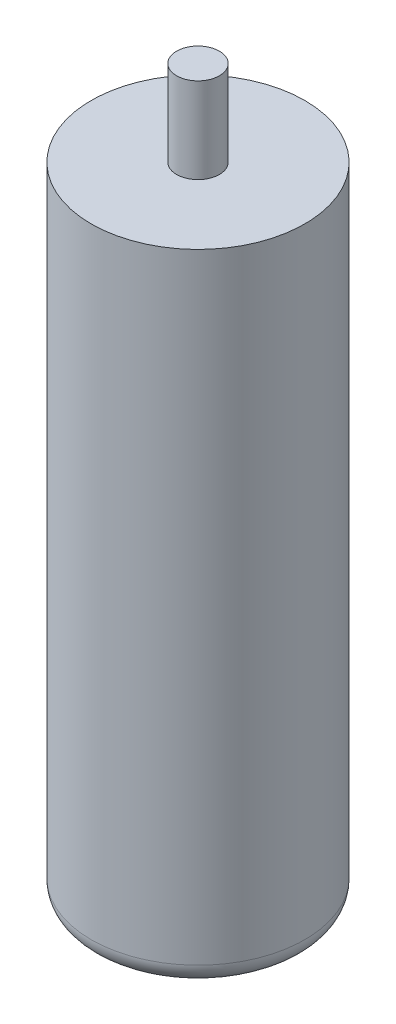
ISO-10303-21;
HEADER;
FILE_DESCRIPTION(('STEP AP214'),'2;1');
FILE_NAME('part.step','',(''),(''),'','','');
FILE_SCHEMA(('AUTOMOTIVE_DESIGN { 1 0 10303 214 1 1 1 1 }'));
ENDSEC;
DATA;
#1=APPLICATION_CONTEXT('core data for automotive mechanical design processes');
#2=APPLICATION_PROTOCOL_DEFINITION('international standard','automotive_design',2000,#1);
#3=PRODUCT_CONTEXT('',#1,'mechanical');
#4=PRODUCT('Part','Part','',(#3));
#5=PRODUCT_RELATED_PRODUCT_CATEGORY('part','',(#4));
#6=PRODUCT_DEFINITION_FORMATION('','',#4);
#7=PRODUCT_DEFINITION_CONTEXT('part definition',#1,'design');
#8=PRODUCT_DEFINITION('design','',#6,#7);
#9=PRODUCT_DEFINITION_SHAPE('','',#8);
#10=(LENGTH_UNIT() NAMED_UNIT(*) SI_UNIT(.MILLI.,.METRE.));
#11=(NAMED_UNIT(*) PLANE_ANGLE_UNIT() SI_UNIT($,.RADIAN.));
#12=(NAMED_UNIT(*) SI_UNIT($,.STERADIAN.) SOLID_ANGLE_UNIT());
#13=UNCERTAINTY_MEASURE_WITH_UNIT(LENGTH_MEASURE(1.E-05),#10,'distance_accuracy_value','');
#14=(GEOMETRIC_REPRESENTATION_CONTEXT(3) GLOBAL_UNCERTAINTY_ASSIGNED_CONTEXT((#13)) GLOBAL_UNIT_ASSIGNED_CONTEXT((#10,
#11,#12)) REPRESENTATION_CONTEXT('',''));
#15=CARTESIAN_POINT('',(0.,0.,0.));
#16=DIRECTION('',(0.,0.,1.));
#17=DIRECTION('',(1.,0.,0.));
#18=AXIS2_PLACEMENT_3D('',#15,#16,#17);
#19=CARTESIAN_POINT('',(0.,150.,0.));
#20=DIRECTION('',(0.,-1.,0.));
#21=DIRECTION('',(0.,0.,-1.));
#22=AXIS2_PLACEMENT_3D('',#19,#20,#21);
#23=CYLINDRICAL_SURFACE('',#22,25.);
#24=CARTESIAN_POINT('',(0.,5.,0.));
#25=DIRECTION('',(0.,1.,0.));
#26=DIRECTION('',(0.,0.,1.));
#27=AXIS2_PLACEMENT_3D('',#24,#25,#26);
#28=CIRCLE('',#27,25.);
#29=CARTESIAN_POINT('',(0.,5.,25.));
#30=VERTEX_POINT('',#29);
#31=EDGE_CURVE('E38',#30,#30,#28,.T.);
#32=ORIENTED_EDGE('',*,*,#31,.T.);
#33=EDGE_LOOP('',(#32));
#34=FACE_BOUND('',#33,.T.);
#35=CARTESIAN_POINT('',(0.,150.,0.));
#36=DIRECTION('',(0.,1.,0.));
#37=DIRECTION('',(0.,0.,1.));
#38=AXIS2_PLACEMENT_3D('',#35,#36,#37);
#39=CIRCLE('',#38,25.);
#40=CARTESIAN_POINT('',(0.,150.,25.));
#41=VERTEX_POINT('',#40);
#42=EDGE_CURVE('E46',#41,#41,#39,.T.);
#43=ORIENTED_EDGE('',*,*,#42,.F.);
#44=EDGE_LOOP('',(#43));
#45=FACE_BOUND('',#44,.T.);
#46=ADVANCED_FACE('F31',(#34,#45),#23,.T.);
#47=CARTESIAN_POINT('',(0.,150.,0.));
#48=DIRECTION('',(0.,1.,0.));
#49=DIRECTION('',(0.,0.,1.));
#50=AXIS2_PLACEMENT_3D('',#47,#48,#49);
#51=PLANE('',#50);
#52=CARTESIAN_POINT('',(0.,150.,0.));
#53=DIRECTION('',(0.,1.,0.));
#54=DIRECTION('',(0.,0.,1.));
#55=AXIS2_PLACEMENT_3D('',#52,#53,#54);
#56=CIRCLE('',#55,5.);
#57=CARTESIAN_POINT('',(0.,150.,5.));
#58=VERTEX_POINT('',#57);
#59=EDGE_CURVE('E42',#58,#58,#56,.T.);
#60=ORIENTED_EDGE('',*,*,#59,.F.);
#61=EDGE_LOOP('',(#60));
#62=FACE_BOUND('',#61,.T.);
#63=ORIENTED_EDGE('',*,*,#42,.T.);
#64=EDGE_LOOP('',(#63));
#65=FACE_BOUND('',#64,.T.);
#66=ADVANCED_FACE('F64',(#62,#65),#51,.T.);
#67=CARTESIAN_POINT('',(0.,0.,0.));
#68=DIRECTION('',(0.,1.,0.));
#69=DIRECTION('',(0.,0.,1.));
#70=AXIS2_PLACEMENT_3D('',#67,#68,#69);
#71=PLANE('',#70);
#72=CARTESIAN_POINT('',(0.,0.,0.));
#73=DIRECTION('',(0.,1.,0.));
#74=DIRECTION('',(0.,0.,1.));
#75=AXIS2_PLACEMENT_3D('',#72,#73,#74);
#76=CIRCLE('',#75,20.);
#77=CARTESIAN_POINT('',(0.,0.,20.));
#78=VERTEX_POINT('',#77);
#79=EDGE_CURVE('E10',#78,#78,#76,.F.);
#80=ORIENTED_EDGE('',*,*,#79,.T.);
#81=EDGE_LOOP('',(#80));
#82=FACE_BOUND('',#81,.T.);
#83=ADVANCED_FACE('F60',(#82),#71,.F.);
#84=CARTESIAN_POINT('',(0.,170.,0.));
#85=DIRECTION('',(0.,-1.,0.));
#86=DIRECTION('',(0.,0.,-1.));
#87=AXIS2_PLACEMENT_3D('',#84,#85,#86);
#88=CYLINDRICAL_SURFACE('',#87,5.);
#89=CARTESIAN_POINT('',(0.,170.,0.));
#90=DIRECTION('',(0.,1.,0.));
#91=DIRECTION('',(0.,0.,1.));
#92=AXIS2_PLACEMENT_3D('',#89,#90,#91);
#93=CIRCLE('',#92,5.);
#94=CARTESIAN_POINT('',(0.,170.,5.));
#95=VERTEX_POINT('',#94);
#96=EDGE_CURVE('E50',#95,#95,#93,.T.);
#97=ORIENTED_EDGE('',*,*,#96,.F.);
#98=EDGE_LOOP('',(#97));
#99=FACE_BOUND('',#98,.T.);
#100=ORIENTED_EDGE('',*,*,#59,.T.);
#101=EDGE_LOOP('',(#100));
#102=FACE_BOUND('',#101,.T.);
#103=ADVANCED_FACE('F57',(#99,#102),#88,.T.);
#104=CARTESIAN_POINT('',(0.,170.,0.));
#105=DIRECTION('',(0.,1.,0.));
#106=DIRECTION('',(0.,0.,1.));
#107=AXIS2_PLACEMENT_3D('',#104,#105,#106);
#108=PLANE('',#107);
#109=ORIENTED_EDGE('',*,*,#96,.T.);
#110=EDGE_LOOP('',(#109));
#111=FACE_BOUND('',#110,.T.);
#112=ADVANCED_FACE('F55',(#111),#108,.T.);
#113=CARTESIAN_POINT('',(0.,5.,0.));
#114=DIRECTION('',(0.,1.,0.));
#115=DIRECTION('',(0.,0.,1.));
#116=AXIS2_PLACEMENT_3D('',#113,#114,#115);
#117=TOROIDAL_SURFACE('',#116,20.,5.);
#118=ORIENTED_EDGE('',*,*,#79,.F.);
#119=EDGE_LOOP('',(#118));
#120=FACE_BOUND('',#119,.T.);
#121=ORIENTED_EDGE('',*,*,#31,.F.);
#122=EDGE_LOOP('',(#121));
#123=FACE_BOUND('',#122,.T.);
#124=ADVANCED_FACE('F33',(#120,#123),#117,.T.);
#125=CLOSED_SHELL('',(#46,#66,#83,#103,#112,#124));
#126=MANIFOLD_SOLID_BREP('B2',#125);
#127=ADVANCED_BREP_SHAPE_REPRESENTATION('',(#18,#126),#14);
#128=SHAPE_DEFINITION_REPRESENTATION(#9,#127);
ENDSEC;
END-ISO-10303-21;
